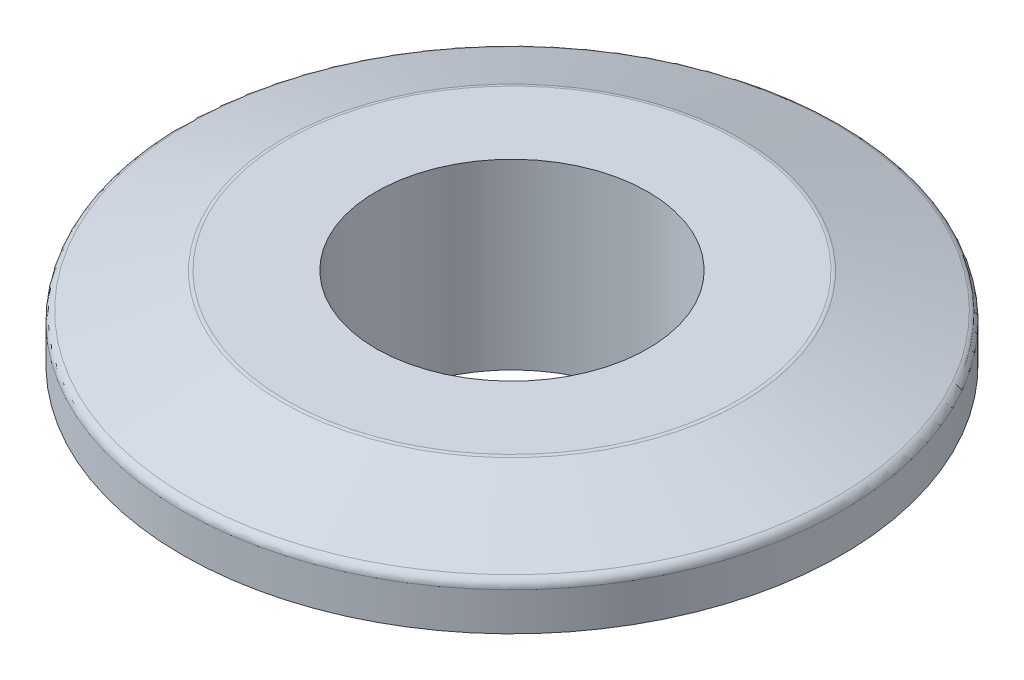
ISO-10303-21;
HEADER;
FILE_DESCRIPTION(('STEP AP214'),'2;1');
FILE_NAME('part.step','',(''),(''),'','','');
FILE_SCHEMA(('AUTOMOTIVE_DESIGN { 1 0 10303 214 1 1 1 1 }'));
ENDSEC;
DATA;
#1=APPLICATION_CONTEXT('core data for automotive mechanical design processes');
#2=APPLICATION_PROTOCOL_DEFINITION('international standard','automotive_design',2000,#1);
#3=PRODUCT_CONTEXT('',#1,'mechanical');
#4=PRODUCT('Part','Part','',(#3));
#5=PRODUCT_RELATED_PRODUCT_CATEGORY('part','',(#4));
#6=PRODUCT_DEFINITION_FORMATION('','',#4);
#7=PRODUCT_DEFINITION_CONTEXT('part definition',#1,'design');
#8=PRODUCT_DEFINITION('design','',#6,#7);
#9=PRODUCT_DEFINITION_SHAPE('','',#8);
#10=(LENGTH_UNIT() NAMED_UNIT(*) SI_UNIT(.MILLI.,.METRE.));
#11=(NAMED_UNIT(*) PLANE_ANGLE_UNIT() SI_UNIT($,.RADIAN.));
#12=(NAMED_UNIT(*) SI_UNIT($,.STERADIAN.) SOLID_ANGLE_UNIT());
#13=UNCERTAINTY_MEASURE_WITH_UNIT(LENGTH_MEASURE(1.E-05),#10,'distance_accuracy_value','');
#14=(GEOMETRIC_REPRESENTATION_CONTEXT(3) GLOBAL_UNCERTAINTY_ASSIGNED_CONTEXT((#13)) GLOBAL_UNIT_ASSIGNED_CONTEXT((#10,
#11,#12)) REPRESENTATION_CONTEXT('',''));
#15=CARTESIAN_POINT('',(0.,0.,0.));
#16=DIRECTION('',(0.,0.,1.));
#17=DIRECTION('',(1.,0.,0.));
#18=AXIS2_PLACEMENT_3D('',#15,#16,#17);
#19=CARTESIAN_POINT('',(0.,0.,0.));
#20=DIRECTION('',(0.,1.,0.));
#21=DIRECTION('',(0.,0.,1.));
#22=AXIS2_PLACEMENT_3D('',#19,#20,#21);
#23=PLANE('',#22);
#24=CARTESIAN_POINT('',(0.,0.,0.));
#25=DIRECTION('',(0.,1.,0.));
#26=DIRECTION('',(0.,0.,1.));
#27=AXIS2_PLACEMENT_3D('',#24,#25,#26);
#28=CIRCLE('',#27,12.065);
#29=CARTESIAN_POINT('',(0.,0.,12.065));
#30=VERTEX_POINT('',#29);
#31=EDGE_CURVE('E54',#30,#30,#28,.F.);
#32=ORIENTED_EDGE('',*,*,#31,.T.);
#33=EDGE_LOOP('',(#32));
#34=FACE_BOUND('',#33,.T.);
#35=CARTESIAN_POINT('',(0.,0.,0.));
#36=DIRECTION('',(0.,1.,0.));
#37=DIRECTION('',(0.,0.,1.));
#38=AXIS2_PLACEMENT_3D('',#35,#36,#37);
#39=CIRCLE('',#38,9.271);
#40=CARTESIAN_POINT('',(0.,0.,9.271));
#41=VERTEX_POINT('',#40);
#42=EDGE_CURVE('E58',#41,#41,#39,.T.);
#43=ORIENTED_EDGE('',*,*,#42,.T.);
#44=EDGE_LOOP('',(#43));
#45=FACE_BOUND('',#44,.T.);
#46=ADVANCED_FACE('F31',(#34,#45),#23,.F.);
#47=CARTESIAN_POINT('',(0.,12.446,0.));
#48=DIRECTION('',(0.,-1.,0.));
#49=DIRECTION('',(0.,0.,-1.));
#50=AXIS2_PLACEMENT_3D('',#47,#48,#49);
#51=CYLINDRICAL_SURFACE('',#50,22.479);
#52=CARTESIAN_POINT('',(0.,9.46136821323683,0.));
#53=DIRECTION('',(0.,1.,0.));
#54=DIRECTION('',(0.,0.,1.));
#55=AXIS2_PLACEMENT_3D('',#52,#53,#54);
#56=CIRCLE('',#55,22.479);
#57=CARTESIAN_POINT('',(0.,9.46136821323683,22.479));
#58=VERTEX_POINT('',#57);
#59=EDGE_CURVE('E10',#58,#58,#56,.F.);
#60=ORIENTED_EDGE('',*,*,#59,.T.);
#61=EDGE_LOOP('',(#60));
#62=FACE_BOUND('',#61,.T.);
#63=CARTESIAN_POINT('',(0.,6.858,0.));
#64=DIRECTION('',(0.,-1.,0.));
#65=DIRECTION('',(0.,0.,-1.));
#66=AXIS2_PLACEMENT_3D('',#63,#64,#65);
#67=CIRCLE('',#66,22.479);
#68=CARTESIAN_POINT('',(0.,6.858,-22.479));
#69=VERTEX_POINT('',#68);
#70=EDGE_CURVE('E61',#69,#69,#67,.T.);
#71=ORIENTED_EDGE('',*,*,#70,.F.);
#72=EDGE_LOOP('',(#71));
#73=FACE_BOUND('',#72,.T.);
#74=ADVANCED_FACE('F79',(#62,#73),#51,.T.);
#75=CARTESIAN_POINT('',(0.,12.446,0.));
#76=DIRECTION('',(0.,1.,0.));
#77=DIRECTION('',(0.,0.,1.));
#78=AXIS2_PLACEMENT_3D('',#75,#76,#77);
#79=PLANE('',#78);
#80=CARTESIAN_POINT('',(0.,12.446,0.));
#81=DIRECTION('',(0.,1.,0.));
#82=DIRECTION('',(0.,0.,1.));
#83=AXIS2_PLACEMENT_3D('',#80,#81,#82);
#84=CIRCLE('',#83,15.3884397218354);
#85=CARTESIAN_POINT('',(0.,12.446,15.3884397218354));
#86=VERTEX_POINT('',#85);
#87=EDGE_CURVE('E46',#86,#86,#84,.T.);
#88=ORIENTED_EDGE('',*,*,#87,.T.);
#89=EDGE_LOOP('',(#88));
#90=FACE_BOUND('',#89,.T.);
#91=CARTESIAN_POINT('',(0.,12.446,0.));
#92=DIRECTION('',(0.,1.,0.));
#93=DIRECTION('',(0.,0.,1.));
#94=AXIS2_PLACEMENT_3D('',#91,#92,#93);
#95=CIRCLE('',#94,9.271);
#96=CARTESIAN_POINT('',(0.,12.446,9.271));
#97=VERTEX_POINT('',#96);
#98=EDGE_CURVE('E57',#97,#97,#95,.T.);
#99=ORIENTED_EDGE('',*,*,#98,.F.);
#100=EDGE_LOOP('',(#99));
#101=FACE_BOUND('',#100,.T.);
#102=ADVANCED_FACE('F81',(#90,#101),#79,.T.);
#103=CARTESIAN_POINT('',(0.,12.446,0.));
#104=DIRECTION('',(0.,-1.,0.));
#105=DIRECTION('',(0.,0.,-1.));
#106=AXIS2_PLACEMENT_3D('',#103,#104,#105);
#107=CYLINDRICAL_SURFACE('',#106,9.271);
#108=ORIENTED_EDGE('',*,*,#98,.T.);
#109=EDGE_LOOP('',(#108));
#110=FACE_BOUND('',#109,.T.);
#111=ORIENTED_EDGE('',*,*,#42,.F.);
#112=EDGE_LOOP('',(#111));
#113=FACE_BOUND('',#112,.T.);
#114=ADVANCED_FACE('F75',(#110,#113),#107,.F.);
#115=CARTESIAN_POINT('',(0.,6.858,0.));
#116=DIRECTION('',(0.,-1.,0.));
#117=DIRECTION('',(0.,0.,-1.));
#118=AXIS2_PLACEMENT_3D('',#115,#116,#117);
#119=PLANE('',#118);
#120=CARTESIAN_POINT('',(0.,6.858,0.));
#121=DIRECTION('',(0.,-1.,0.));
#122=DIRECTION('',(0.,0.,-1.));
#123=AXIS2_PLACEMENT_3D('',#120,#121,#122);
#124=CIRCLE('',#123,12.7);
#125=CARTESIAN_POINT('',(0.,6.858,-12.7));
#126=VERTEX_POINT('',#125);
#127=EDGE_CURVE('E66',#126,#126,#124,.T.);
#128=ORIENTED_EDGE('',*,*,#127,.F.);
#129=EDGE_LOOP('',(#128));
#130=FACE_BOUND('',#129,.T.);
#131=ORIENTED_EDGE('',*,*,#70,.T.);
#132=EDGE_LOOP('',(#131));
#133=FACE_BOUND('',#132,.T.);
#134=ADVANCED_FACE('F72',(#130,#133),#119,.T.);
#135=CARTESIAN_POINT('',(0.,6.858,0.));
#136=DIRECTION('',(0.,-1.,0.));
#137=DIRECTION('',(0.,0.,-1.));
#138=AXIS2_PLACEMENT_3D('',#135,#136,#137);
#139=CYLINDRICAL_SURFACE('',#138,12.7);
#140=CARTESIAN_POINT('',(0.,0.634999999999988,0.));
#141=DIRECTION('',(0.,1.,0.));
#142=DIRECTION('',(0.,0.,1.));
#143=AXIS2_PLACEMENT_3D('',#140,#141,#142);
#144=CIRCLE('',#143,12.7);
#145=CARTESIAN_POINT('',(0.,0.634999999999988,12.7));
#146=VERTEX_POINT('',#145);
#147=EDGE_CURVE('E51',#146,#146,#144,.T.);
#148=ORIENTED_EDGE('',*,*,#147,.T.);
#149=EDGE_LOOP('',(#148));
#150=FACE_BOUND('',#149,.T.);
#151=ORIENTED_EDGE('',*,*,#127,.T.);
#152=EDGE_LOOP('',(#151));
#153=FACE_BOUND('',#152,.T.);
#154=ADVANCED_FACE('F70',(#150,#153),#139,.T.);
#155=CARTESIAN_POINT('',(0.,12.446,0.));
#156=DIRECTION('',(0.,-1.,0.));
#157=DIRECTION('',(0.,0.,-1.));
#158=AXIS2_PLACEMENT_3D('',#155,#156,#157);
#159=CONICAL_SURFACE('',#158,15.5004073545853,1.22173047639603);
#160=CARTESIAN_POINT('',(0.,12.4077048141991,0.));
#161=DIRECTION('',(0.,1.,0.));
#162=DIRECTION('',(0.,0.,1.));
#163=AXIS2_PLACEMENT_3D('',#160,#161,#162);
#164=CIRCLE('',#163,15.6056225128472);
#165=CARTESIAN_POINT('',(0.,12.4077048141991,15.6056225128472));
#166=VERTEX_POINT('',#165);
#167=EDGE_CURVE('E38',#166,#166,#164,.F.);
#168=ORIENTED_EDGE('',*,*,#167,.T.);
#169=EDGE_LOOP('',(#168));
#170=FACE_BOUND('',#169,.T.);
#171=CARTESIAN_POINT('',(0.,10.0580730274359,0.));
#172=DIRECTION('',(0.,-1.,0.));
#173=DIRECTION('',(0.,0.,-1.));
#174=AXIS2_PLACEMENT_3D('',#171,#172,#173);
#175=CIRCLE('',#174,22.0611827910118);
#176=CARTESIAN_POINT('',(0.,10.0580730274359,-22.0611827910118));
#177=VERTEX_POINT('',#176);
#178=EDGE_CURVE('E42',#177,#177,#175,.F.);
#179=ORIENTED_EDGE('',*,*,#178,.T.);
#180=EDGE_LOOP('',(#179));
#181=FACE_BOUND('',#180,.T.);
#182=ADVANCED_FACE('F92',(#170,#181),#159,.T.);
#183=CARTESIAN_POINT('',(0.,0.,0.));
#184=DIRECTION('',(0.,1.,0.));
#185=DIRECTION('',(0.,0.,1.));
#186=AXIS2_PLACEMENT_3D('',#183,#184,#185);
#187=CONICAL_SURFACE('',#186,12.065,0.785398163397452);
#188=ORIENTED_EDGE('',*,*,#147,.F.);
#189=EDGE_LOOP('',(#188));
#190=FACE_BOUND('',#189,.T.);
#191=ORIENTED_EDGE('',*,*,#31,.F.);
#192=EDGE_LOOP('',(#191));
#193=FACE_BOUND('',#192,.T.);
#194=ADVANCED_FACE('F95',(#190,#193),#187,.T.);
#195=CARTESIAN_POINT('',(0.,11.811,0.));
#196=DIRECTION('',(0.,1.,0.));
#197=DIRECTION('',(0.,0.,1.));
#198=AXIS2_PLACEMENT_3D('',#195,#196,#197);
#199=TOROIDAL_SURFACE('',#198,15.3884397218354,0.635);
#200=ORIENTED_EDGE('',*,*,#167,.F.);
#201=EDGE_LOOP('',(#200));
#202=FACE_BOUND('',#201,.T.);
#203=ORIENTED_EDGE('',*,*,#87,.F.);
#204=EDGE_LOOP('',(#203));
#205=FACE_BOUND('',#204,.T.);
#206=ADVANCED_FACE('F97',(#202,#205),#199,.T.);
#207=CARTESIAN_POINT('',(0.,9.46136821323683,0.));
#208=DIRECTION('',(0.,1.,0.));
#209=DIRECTION('',(0.,0.,1.));
#210=AXIS2_PLACEMENT_3D('',#207,#208,#209);
#211=TOROIDAL_SURFACE('',#210,21.844,0.635);
#212=ORIENTED_EDGE('',*,*,#178,.F.);
#213=EDGE_LOOP('',(#212));
#214=FACE_BOUND('',#213,.T.);
#215=ORIENTED_EDGE('',*,*,#59,.F.);
#216=EDGE_LOOP('',(#215));
#217=FACE_BOUND('',#216,.T.);
#218=ADVANCED_FACE('F33',(#214,#217),#211,.T.);
#219=CLOSED_SHELL('',(#46,#74,#102,#114,#134,#154,#182,#194,#206,#218));
#220=MANIFOLD_SOLID_BREP('B2',#219);
#221=ADVANCED_BREP_SHAPE_REPRESENTATION('',(#18,#220),#14);
#222=SHAPE_DEFINITION_REPRESENTATION(#9,#221);
ENDSEC;
END-ISO-10303-21;
